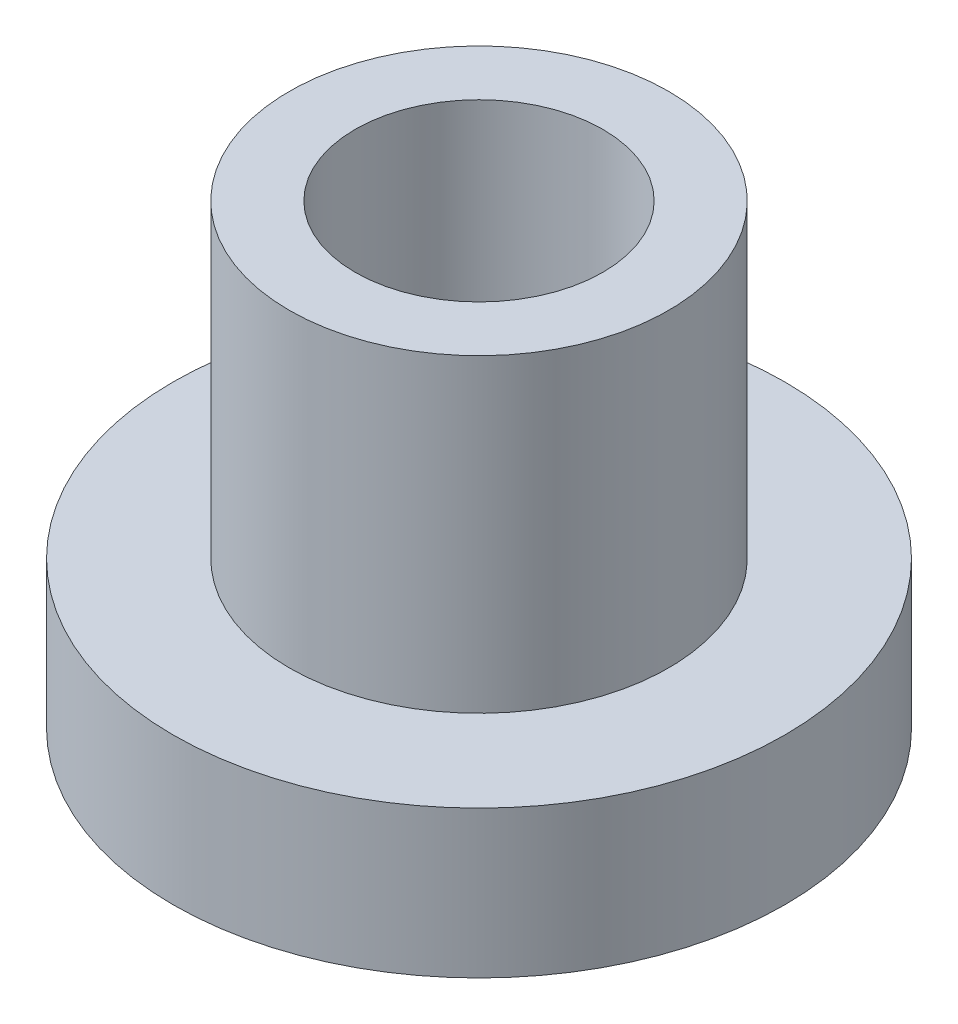
ISO-10303-21;
HEADER;
FILE_DESCRIPTION(('STEP AP214'),'2;1');
FILE_NAME('part.step','',(''),(''),'','','');
FILE_SCHEMA(('AUTOMOTIVE_DESIGN { 1 0 10303 214 1 1 1 1 }'));
ENDSEC;
DATA;
#1=APPLICATION_CONTEXT('core data for automotive mechanical design processes');
#2=APPLICATION_PROTOCOL_DEFINITION('international standard','automotive_design',2000,#1);
#3=PRODUCT_CONTEXT('',#1,'mechanical');
#4=PRODUCT('Part','Part','',(#3));
#5=PRODUCT_RELATED_PRODUCT_CATEGORY('part','',(#4));
#6=PRODUCT_DEFINITION_FORMATION('','',#4);
#7=PRODUCT_DEFINITION_CONTEXT('part definition',#1,'design');
#8=PRODUCT_DEFINITION('design','',#6,#7);
#9=PRODUCT_DEFINITION_SHAPE('','',#8);
#10=(LENGTH_UNIT() NAMED_UNIT(*) SI_UNIT(.MILLI.,.METRE.));
#11=(NAMED_UNIT(*) PLANE_ANGLE_UNIT() SI_UNIT($,.RADIAN.));
#12=(NAMED_UNIT(*) SI_UNIT($,.STERADIAN.) SOLID_ANGLE_UNIT());
#13=UNCERTAINTY_MEASURE_WITH_UNIT(LENGTH_MEASURE(1.E-05),#10,'distance_accuracy_value','');
#14=(GEOMETRIC_REPRESENTATION_CONTEXT(3) GLOBAL_UNCERTAINTY_ASSIGNED_CONTEXT((#13)) GLOBAL_UNIT_ASSIGNED_CONTEXT((#10,
#11,#12)) REPRESENTATION_CONTEXT('',''));
#15=CARTESIAN_POINT('',(0.,0.,0.));
#16=DIRECTION('',(0.,0.,1.));
#17=DIRECTION('',(1.,0.,0.));
#18=AXIS2_PLACEMENT_3D('',#15,#16,#17);
#19=CARTESIAN_POINT('',(0.,1.9,0.));
#20=DIRECTION('',(0.,1.,0.));
#21=DIRECTION('',(0.,0.,1.));
#22=AXIS2_PLACEMENT_3D('',#19,#20,#21);
#23=PLANE('',#22);
#24=CARTESIAN_POINT('',(0.,1.9,0.));
#25=DIRECTION('',(0.,1.,0.));
#26=DIRECTION('',(0.,0.,1.));
#27=AXIS2_PLACEMENT_3D('',#24,#25,#26);
#28=CIRCLE('',#27,3.95);
#29=CARTESIAN_POINT('',(0.,1.9,3.95));
#30=VERTEX_POINT('',#29);
#31=EDGE_CURVE('E10',#30,#30,#28,.T.);
#32=ORIENTED_EDGE('',*,*,#31,.T.);
#33=EDGE_LOOP('',(#32));
#34=FACE_BOUND('',#33,.T.);
#35=CARTESIAN_POINT('',(0.,1.9,0.));
#36=DIRECTION('',(0.,1.,0.));
#37=DIRECTION('',(0.,0.,1.));
#38=AXIS2_PLACEMENT_3D('',#35,#36,#37);
#39=CIRCLE('',#38,2.45);
#40=CARTESIAN_POINT('',(0.,1.9,2.45));
#41=VERTEX_POINT('',#40);
#42=EDGE_CURVE('E46',#41,#41,#39,.T.);
#43=ORIENTED_EDGE('',*,*,#42,.F.);
#44=EDGE_LOOP('',(#43));
#45=FACE_BOUND('',#44,.T.);
#46=ADVANCED_FACE('F30',(#34,#45),#23,.T.);
#47=CARTESIAN_POINT('',(0.,0.,0.));
#48=DIRECTION('',(0.,1.,0.));
#49=DIRECTION('',(0.,0.,1.));
#50=AXIS2_PLACEMENT_3D('',#47,#48,#49);
#51=PLANE('',#50);
#52=CARTESIAN_POINT('',(0.,0.,0.));
#53=DIRECTION('',(0.,1.,0.));
#54=DIRECTION('',(0.,0.,1.));
#55=AXIS2_PLACEMENT_3D('',#52,#53,#54);
#56=CIRCLE('',#55,3.95);
#57=CARTESIAN_POINT('',(0.,0.,3.95));
#58=VERTEX_POINT('',#57);
#59=EDGE_CURVE('E34',#58,#58,#56,.T.);
#60=ORIENTED_EDGE('',*,*,#59,.F.);
#61=EDGE_LOOP('',(#60));
#62=FACE_BOUND('',#61,.T.);
#63=CARTESIAN_POINT('',(0.,0.,0.));
#64=DIRECTION('',(0.,1.,0.));
#65=DIRECTION('',(0.,0.,1.));
#66=AXIS2_PLACEMENT_3D('',#63,#64,#65);
#67=CIRCLE('',#66,1.6);
#68=CARTESIAN_POINT('',(0.,0.,1.6));
#69=VERTEX_POINT('',#68);
#70=EDGE_CURVE('E41',#69,#69,#67,.T.);
#71=ORIENTED_EDGE('',*,*,#70,.T.);
#72=EDGE_LOOP('',(#71));
#73=FACE_BOUND('',#72,.T.);
#74=ADVANCED_FACE('F71',(#62,#73),#51,.F.);
#75=CARTESIAN_POINT('',(0.,1.9,0.));
#76=DIRECTION('',(0.,-1.,0.));
#77=DIRECTION('',(0.,0.,-1.));
#78=AXIS2_PLACEMENT_3D('',#75,#76,#77);
#79=CYLINDRICAL_SURFACE('',#78,3.95);
#80=ORIENTED_EDGE('',*,*,#31,.F.);
#81=EDGE_LOOP('',(#80));
#82=FACE_BOUND('',#81,.T.);
#83=ORIENTED_EDGE('',*,*,#59,.T.);
#84=EDGE_LOOP('',(#83));
#85=FACE_BOUND('',#84,.T.);
#86=ADVANCED_FACE('F32',(#82,#85),#79,.T.);
#87=CARTESIAN_POINT('',(0.,1.9,0.));
#88=DIRECTION('',(0.,-1.,0.));
#89=DIRECTION('',(0.,0.,-1.));
#90=AXIS2_PLACEMENT_3D('',#87,#88,#89);
#91=CYLINDRICAL_SURFACE('',#90,1.6);
#92=ORIENTED_EDGE('',*,*,#70,.F.);
#93=EDGE_LOOP('',(#92));
#94=FACE_BOUND('',#93,.T.);
#95=CARTESIAN_POINT('',(0.,5.9,0.));
#96=DIRECTION('',(0.,1.,0.));
#97=DIRECTION('',(0.,0.,1.));
#98=AXIS2_PLACEMENT_3D('',#95,#96,#97);
#99=CIRCLE('',#98,1.6);
#100=CARTESIAN_POINT('',(0.,5.9,1.6));
#101=VERTEX_POINT('',#100);
#102=EDGE_CURVE('E49',#101,#101,#99,.T.);
#103=ORIENTED_EDGE('',*,*,#102,.T.);
#104=EDGE_LOOP('',(#103));
#105=FACE_BOUND('',#104,.T.);
#106=ADVANCED_FACE('F55',(#94,#105),#91,.F.);
#107=CARTESIAN_POINT('',(0.,5.9,0.));
#108=DIRECTION('',(0.,1.,0.));
#109=DIRECTION('',(0.,0.,1.));
#110=AXIS2_PLACEMENT_3D('',#107,#108,#109);
#111=PLANE('',#110);
#112=CARTESIAN_POINT('',(0.,5.9,0.));
#113=DIRECTION('',(0.,1.,0.));
#114=DIRECTION('',(0.,0.,1.));
#115=AXIS2_PLACEMENT_3D('',#112,#113,#114);
#116=CIRCLE('',#115,2.45);
#117=CARTESIAN_POINT('',(0.,5.9,2.45));
#118=VERTEX_POINT('',#117);
#119=EDGE_CURVE('E45',#118,#118,#116,.T.);
#120=ORIENTED_EDGE('',*,*,#119,.T.);
#121=EDGE_LOOP('',(#120));
#122=FACE_BOUND('',#121,.T.);
#123=ORIENTED_EDGE('',*,*,#102,.F.);
#124=EDGE_LOOP('',(#123));
#125=FACE_BOUND('',#124,.T.);
#126=ADVANCED_FACE('F57',(#122,#125),#111,.T.);
#127=CARTESIAN_POINT('',(0.,5.9,0.));
#128=DIRECTION('',(0.,-1.,0.));
#129=DIRECTION('',(0.,0.,-1.));
#130=AXIS2_PLACEMENT_3D('',#127,#128,#129);
#131=CYLINDRICAL_SURFACE('',#130,2.45);
#132=ORIENTED_EDGE('',*,*,#119,.F.);
#133=EDGE_LOOP('',(#132));
#134=FACE_BOUND('',#133,.T.);
#135=ORIENTED_EDGE('',*,*,#42,.T.);
#136=EDGE_LOOP('',(#135));
#137=FACE_BOUND('',#136,.T.);
#138=ADVANCED_FACE('F59',(#134,#137),#131,.T.);
#139=CLOSED_SHELL('',(#46,#74,#86,#106,#126,#138));
#140=MANIFOLD_SOLID_BREP('B2',#139);
#141=ADVANCED_BREP_SHAPE_REPRESENTATION('',(#18,#140),#14);
#142=SHAPE_DEFINITION_REPRESENTATION(#9,#141);
ENDSEC;
END-ISO-10303-21;
